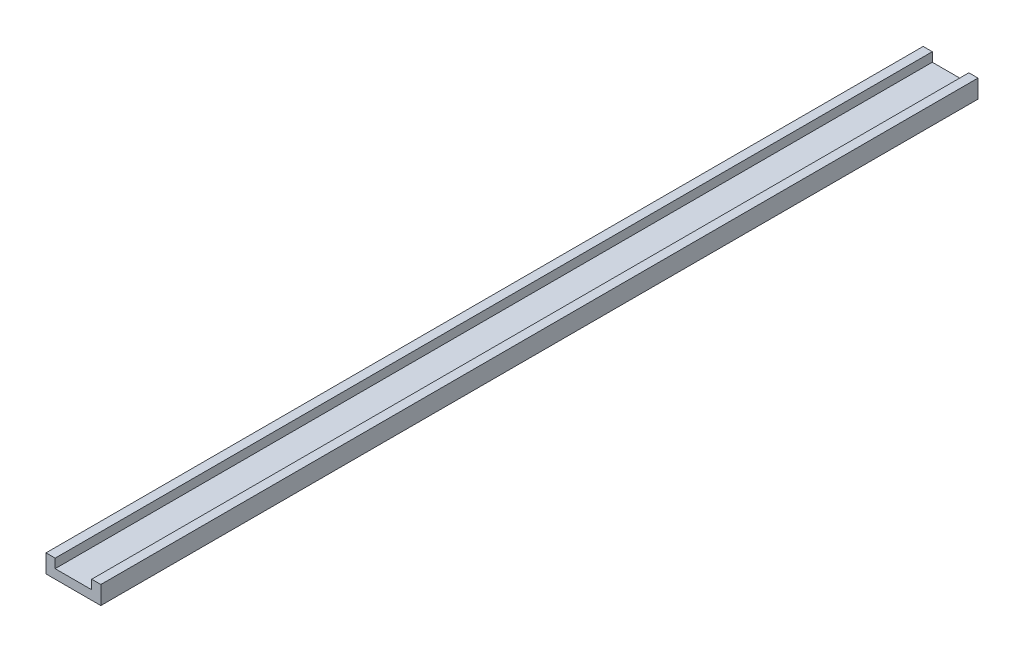
ISO-10303-21;
HEADER;
FILE_DESCRIPTION(('STEP AP214'),'2;1');
FILE_NAME('part.step','',(''),(''),'','','');
FILE_SCHEMA(('AUTOMOTIVE_DESIGN { 1 0 10303 214 1 1 1 1 }'));
ENDSEC;
DATA;
#1=APPLICATION_CONTEXT('core data for automotive mechanical design processes');
#2=APPLICATION_PROTOCOL_DEFINITION('international standard','automotive_design',2000,#1);
#3=PRODUCT_CONTEXT('',#1,'mechanical');
#4=PRODUCT('Part','Part','',(#3));
#5=PRODUCT_RELATED_PRODUCT_CATEGORY('part','',(#4));
#6=PRODUCT_DEFINITION_FORMATION('','',#4);
#7=PRODUCT_DEFINITION_CONTEXT('part definition',#1,'design');
#8=PRODUCT_DEFINITION('design','',#6,#7);
#9=PRODUCT_DEFINITION_SHAPE('','',#8);
#10=(LENGTH_UNIT() NAMED_UNIT(*) SI_UNIT(.MILLI.,.METRE.));
#11=(NAMED_UNIT(*) PLANE_ANGLE_UNIT() SI_UNIT($,.RADIAN.));
#12=(NAMED_UNIT(*) SI_UNIT($,.STERADIAN.) SOLID_ANGLE_UNIT());
#13=UNCERTAINTY_MEASURE_WITH_UNIT(LENGTH_MEASURE(1.E-05),#10,'distance_accuracy_value','');
#14=(GEOMETRIC_REPRESENTATION_CONTEXT(3) GLOBAL_UNCERTAINTY_ASSIGNED_CONTEXT((#13)) GLOBAL_UNIT_ASSIGNED_CONTEXT((#10,
#11,#12)) REPRESENTATION_CONTEXT('',''));
#15=CARTESIAN_POINT('',(0.,0.,0.));
#16=DIRECTION('',(0.,0.,1.));
#17=DIRECTION('',(1.,0.,0.));
#18=AXIS2_PLACEMENT_3D('',#15,#16,#17);
#19=CARTESIAN_POINT('',(0.,6.35,304.8));
#20=DIRECTION('',(0.,-1.,0.));
#21=DIRECTION('',(0.,0.,-1.));
#22=AXIS2_PLACEMENT_3D('',#19,#20,#21);
#23=PLANE('',#22);
#24=DIRECTION('',(-1.,0.,0.));
#25=VECTOR('',#24,1.);
#26=CARTESIAN_POINT('',(0.,6.35,304.8));
#27=LINE('',#26,#25);
#28=CARTESIAN_POINT('',(3.175,6.35,304.8));
#29=VERTEX_POINT('',#28);
#30=CARTESIAN_POINT('',(0.,6.35,304.8));
#31=VERTEX_POINT('',#30);
#32=EDGE_CURVE('E64',#29,#31,#27,.T.);
#33=ORIENTED_EDGE('',*,*,#32,.F.);
#34=DIRECTION('',(0.,0.,1.));
#35=VECTOR('',#34,1.);
#36=CARTESIAN_POINT('',(3.175,6.35,0.));
#37=LINE('',#36,#35);
#38=CARTESIAN_POINT('',(3.175,6.35,0.));
#39=VERTEX_POINT('',#38);
#40=EDGE_CURVE('E147',#39,#29,#37,.T.);
#41=ORIENTED_EDGE('',*,*,#40,.F.);
#42=DIRECTION('',(-1.,0.,0.));
#43=VECTOR('',#42,1.);
#44=CARTESIAN_POINT('',(0.,6.35,0.));
#45=LINE('',#44,#43);
#46=CARTESIAN_POINT('',(0.,6.35,0.));
#47=VERTEX_POINT('',#46);
#48=EDGE_CURVE('E86',#39,#47,#45,.T.);
#49=ORIENTED_EDGE('',*,*,#48,.T.);
#50=DIRECTION('',(0.,0.,-1.));
#51=VECTOR('',#50,1.);
#52=CARTESIAN_POINT('',(0.,6.35,304.8));
#53=LINE('',#52,#51);
#54=EDGE_CURVE('E170',#31,#47,#53,.T.);
#55=ORIENTED_EDGE('',*,*,#54,.F.);
#56=EDGE_LOOP('',(#33,#41,#49,#55));
#57=FACE_BOUND('',#56,.T.);
#58=ADVANCED_FACE('F39',(#57),#23,.F.);
#59=CARTESIAN_POINT('',(0.,0.,304.8));
#60=DIRECTION('',(1.,0.,0.));
#61=DIRECTION('',(0.,0.,-1.));
#62=AXIS2_PLACEMENT_3D('',#59,#60,#61);
#63=PLANE('',#62);
#64=DIRECTION('',(0.,-1.,0.));
#65=VECTOR('',#64,1.);
#66=CARTESIAN_POINT('',(0.,0.,0.));
#67=LINE('',#66,#65);
#68=CARTESIAN_POINT('',(0.,0.,0.));
#69=VERTEX_POINT('',#68);
#70=EDGE_CURVE('E150',#47,#69,#67,.T.);
#71=ORIENTED_EDGE('',*,*,#70,.T.);
#72=DIRECTION('',(0.,0.,-1.));
#73=VECTOR('',#72,1.);
#74=CARTESIAN_POINT('',(0.,0.,304.8));
#75=LINE('',#74,#73);
#76=CARTESIAN_POINT('',(0.,0.,304.8));
#77=VERTEX_POINT('',#76);
#78=EDGE_CURVE('E11',#77,#69,#75,.T.);
#79=ORIENTED_EDGE('',*,*,#78,.F.);
#80=DIRECTION('',(0.,-1.,0.));
#81=VECTOR('',#80,1.);
#82=CARTESIAN_POINT('',(0.,0.,304.8));
#83=LINE('',#82,#81);
#84=EDGE_CURVE('E157',#31,#77,#83,.T.);
#85=ORIENTED_EDGE('',*,*,#84,.F.);
#86=ORIENTED_EDGE('',*,*,#54,.T.);
#87=EDGE_LOOP('',(#71,#79,#85,#86));
#88=FACE_BOUND('',#87,.T.);
#89=ADVANCED_FACE('F41',(#88),#63,.F.);
#90=CARTESIAN_POINT('',(0.,0.,304.8));
#91=DIRECTION('',(0.,1.,0.));
#92=DIRECTION('',(0.,0.,1.));
#93=AXIS2_PLACEMENT_3D('',#90,#91,#92);
#94=PLANE('',#93);
#95=DIRECTION('',(1.,0.,0.));
#96=VECTOR('',#95,1.);
#97=CARTESIAN_POINT('',(0.,0.,0.));
#98=LINE('',#97,#96);
#99=CARTESIAN_POINT('',(19.05,0.,0.));
#100=VERTEX_POINT('',#99);
#101=EDGE_CURVE('E174',#69,#100,#98,.T.);
#102=ORIENTED_EDGE('',*,*,#101,.T.);
#103=DIRECTION('',(0.,0.,-1.));
#104=VECTOR('',#103,1.);
#105=CARTESIAN_POINT('',(19.05,0.,304.8));
#106=LINE('',#105,#104);
#107=CARTESIAN_POINT('',(19.05,0.,304.8));
#108=VERTEX_POINT('',#107);
#109=EDGE_CURVE('E48',#108,#100,#106,.T.);
#110=ORIENTED_EDGE('',*,*,#109,.F.);
#111=DIRECTION('',(1.,0.,0.));
#112=VECTOR('',#111,1.);
#113=CARTESIAN_POINT('',(0.,0.,304.8));
#114=LINE('',#113,#112);
#115=EDGE_CURVE('E93',#77,#108,#114,.T.);
#116=ORIENTED_EDGE('',*,*,#115,.F.);
#117=ORIENTED_EDGE('',*,*,#78,.T.);
#118=EDGE_LOOP('',(#102,#110,#116,#117));
#119=FACE_BOUND('',#118,.T.);
#120=ADVANCED_FACE('F204',(#119),#94,.F.);
#121=CARTESIAN_POINT('',(19.05,0.,304.8));
#122=DIRECTION('',(-1.,0.,0.));
#123=DIRECTION('',(0.,0.,1.));
#124=AXIS2_PLACEMENT_3D('',#121,#122,#123);
#125=PLANE('',#124);
#126=DIRECTION('',(0.,1.,0.));
#127=VECTOR('',#126,1.);
#128=CARTESIAN_POINT('',(19.05,0.,0.));
#129=LINE('',#128,#127);
#130=CARTESIAN_POINT('',(19.05,6.35,0.));
#131=VERTEX_POINT('',#130);
#132=EDGE_CURVE('E177',#100,#131,#129,.T.);
#133=ORIENTED_EDGE('',*,*,#132,.T.);
#134=DIRECTION('',(0.,0.,-1.));
#135=VECTOR('',#134,1.);
#136=CARTESIAN_POINT('',(19.05,6.35,304.8));
#137=LINE('',#136,#135);
#138=CARTESIAN_POINT('',(19.05,6.35,304.8));
#139=VERTEX_POINT('',#138);
#140=EDGE_CURVE('E185',#139,#131,#137,.T.);
#141=ORIENTED_EDGE('',*,*,#140,.F.);
#142=DIRECTION('',(0.,1.,0.));
#143=VECTOR('',#142,1.);
#144=CARTESIAN_POINT('',(19.05,0.,304.8));
#145=LINE('',#144,#143);
#146=EDGE_CURVE('E163',#108,#139,#145,.T.);
#147=ORIENTED_EDGE('',*,*,#146,.F.);
#148=ORIENTED_EDGE('',*,*,#109,.T.);
#149=EDGE_LOOP('',(#133,#141,#147,#148));
#150=FACE_BOUND('',#149,.T.);
#151=ADVANCED_FACE('F193',(#150),#125,.F.);
#152=CARTESIAN_POINT('',(15.875,6.35,0.));
#153=VERTEX_POINT('',#152);
#154=EDGE_CURVE('E160',#131,#153,#45,.T.);
#155=ORIENTED_EDGE('',*,*,#154,.T.);
#156=DIRECTION('',(0.,0.,1.));
#157=VECTOR('',#156,1.);
#158=CARTESIAN_POINT('',(15.875,6.35,0.));
#159=LINE('',#158,#157);
#160=CARTESIAN_POINT('',(15.875,6.35,304.8));
#161=VERTEX_POINT('',#160);
#162=EDGE_CURVE('E151',#153,#161,#159,.T.);
#163=ORIENTED_EDGE('',*,*,#162,.T.);
#164=EDGE_CURVE('E166',#139,#161,#27,.T.);
#165=ORIENTED_EDGE('',*,*,#164,.F.);
#166=ORIENTED_EDGE('',*,*,#140,.T.);
#167=EDGE_LOOP('',(#155,#163,#165,#166));
#168=FACE_BOUND('',#167,.T.);
#169=ADVANCED_FACE('F197',(#168),#23,.F.);
#170=CARTESIAN_POINT('',(0.,0.,304.8));
#171=DIRECTION('',(0.,0.,-1.));
#172=DIRECTION('',(-1.,0.,0.));
#173=AXIS2_PLACEMENT_3D('',#170,#171,#172);
#174=PLANE('',#173);
#175=DIRECTION('',(1.,0.,0.));
#176=VECTOR('',#175,1.);
#177=CARTESIAN_POINT('',(3.175,3.175,304.8));
#178=LINE('',#177,#176);
#179=CARTESIAN_POINT('',(3.175,3.175,304.8));
#180=VERTEX_POINT('',#179);
#181=CARTESIAN_POINT('',(15.875,3.175,304.8));
#182=VERTEX_POINT('',#181);
#183=EDGE_CURVE('E138',#180,#182,#178,.T.);
#184=ORIENTED_EDGE('',*,*,#183,.F.);
#185=DIRECTION('',(0.,-1.,0.));
#186=VECTOR('',#185,1.);
#187=CARTESIAN_POINT('',(3.175,6.35,304.8));
#188=LINE('',#187,#186);
#189=EDGE_CURVE('E119',#29,#180,#188,.T.);
#190=ORIENTED_EDGE('',*,*,#189,.F.);
#191=ORIENTED_EDGE('',*,*,#32,.T.);
#192=ORIENTED_EDGE('',*,*,#84,.T.);
#193=ORIENTED_EDGE('',*,*,#115,.T.);
#194=ORIENTED_EDGE('',*,*,#146,.T.);
#195=ORIENTED_EDGE('',*,*,#164,.T.);
#196=DIRECTION('',(0.,1.,0.));
#197=VECTOR('',#196,1.);
#198=CARTESIAN_POINT('',(15.875,6.35,304.8));
#199=LINE('',#198,#197);
#200=EDGE_CURVE('E135',#182,#161,#199,.T.);
#201=ORIENTED_EDGE('',*,*,#200,.F.);
#202=EDGE_LOOP('',(#184,#190,#191,#192,#193,#194,#195,#201));
#203=FACE_BOUND('',#202,.T.);
#204=ADVANCED_FACE('F200',(#203),#174,.F.);
#205=CARTESIAN_POINT('',(0.,0.,0.));
#206=DIRECTION('',(0.,0.,-1.));
#207=DIRECTION('',(-1.,0.,0.));
#208=AXIS2_PLACEMENT_3D('',#205,#206,#207);
#209=PLANE('',#208);
#210=DIRECTION('',(0.,-1.,0.));
#211=VECTOR('',#210,1.);
#212=CARTESIAN_POINT('',(3.175,6.35,0.));
#213=LINE('',#212,#211);
#214=CARTESIAN_POINT('',(3.175,3.175,0.));
#215=VERTEX_POINT('',#214);
#216=EDGE_CURVE('E118',#39,#215,#213,.T.);
#217=ORIENTED_EDGE('',*,*,#216,.T.);
#218=DIRECTION('',(1.,0.,0.));
#219=VECTOR('',#218,1.);
#220=CARTESIAN_POINT('',(3.175,3.175,0.));
#221=LINE('',#220,#219);
#222=CARTESIAN_POINT('',(15.875,3.175,0.));
#223=VERTEX_POINT('',#222);
#224=EDGE_CURVE('E127',#215,#223,#221,.T.);
#225=ORIENTED_EDGE('',*,*,#224,.T.);
#226=DIRECTION('',(0.,1.,0.));
#227=VECTOR('',#226,1.);
#228=CARTESIAN_POINT('',(15.875,6.35,0.));
#229=LINE('',#228,#227);
#230=EDGE_CURVE('E55',#223,#153,#229,.T.);
#231=ORIENTED_EDGE('',*,*,#230,.T.);
#232=ORIENTED_EDGE('',*,*,#154,.F.);
#233=ORIENTED_EDGE('',*,*,#132,.F.);
#234=ORIENTED_EDGE('',*,*,#101,.F.);
#235=ORIENTED_EDGE('',*,*,#70,.F.);
#236=ORIENTED_EDGE('',*,*,#48,.F.);
#237=EDGE_LOOP('',(#217,#225,#231,#232,#233,#234,#235,#236));
#238=FACE_BOUND('',#237,.T.);
#239=ADVANCED_FACE('F132',(#238),#209,.T.);
#240=CARTESIAN_POINT('',(3.175,6.35,0.));
#241=DIRECTION('',(-1.,0.,0.));
#242=DIRECTION('',(0.,-1.,0.));
#243=AXIS2_PLACEMENT_3D('',#240,#241,#242);
#244=PLANE('',#243);
#245=ORIENTED_EDGE('',*,*,#189,.T.);
#246=DIRECTION('',(0.,0.,1.));
#247=VECTOR('',#246,1.);
#248=CARTESIAN_POINT('',(3.175,3.175,0.));
#249=LINE('',#248,#247);
#250=EDGE_CURVE('E114',#215,#180,#249,.T.);
#251=ORIENTED_EDGE('',*,*,#250,.F.);
#252=ORIENTED_EDGE('',*,*,#216,.F.);
#253=ORIENTED_EDGE('',*,*,#40,.T.);
#254=EDGE_LOOP('',(#245,#251,#252,#253));
#255=FACE_BOUND('',#254,.T.);
#256=ADVANCED_FACE('F116',(#255),#244,.F.);
#257=CARTESIAN_POINT('',(15.875,6.35,0.));
#258=DIRECTION('',(1.,0.,0.));
#259=DIRECTION('',(0.,0.,-1.));
#260=AXIS2_PLACEMENT_3D('',#257,#258,#259);
#261=PLANE('',#260);
#262=ORIENTED_EDGE('',*,*,#200,.T.);
#263=ORIENTED_EDGE('',*,*,#162,.F.);
#264=ORIENTED_EDGE('',*,*,#230,.F.);
#265=DIRECTION('',(0.,0.,1.));
#266=VECTOR('',#265,1.);
#267=CARTESIAN_POINT('',(15.875,3.175,0.));
#268=LINE('',#267,#266);
#269=EDGE_CURVE('E124',#223,#182,#268,.T.);
#270=ORIENTED_EDGE('',*,*,#269,.T.);
#271=EDGE_LOOP('',(#262,#263,#264,#270));
#272=FACE_BOUND('',#271,.T.);
#273=ADVANCED_FACE('F227',(#272),#261,.F.);
#274=CARTESIAN_POINT('',(3.175,3.175,0.));
#275=DIRECTION('',(0.,-1.,0.));
#276=DIRECTION('',(0.,0.,-1.));
#277=AXIS2_PLACEMENT_3D('',#274,#275,#276);
#278=PLANE('',#277);
#279=ORIENTED_EDGE('',*,*,#183,.T.);
#280=ORIENTED_EDGE('',*,*,#269,.F.);
#281=ORIENTED_EDGE('',*,*,#224,.F.);
#282=ORIENTED_EDGE('',*,*,#250,.T.);
#283=EDGE_LOOP('',(#279,#280,#281,#282));
#284=FACE_BOUND('',#283,.T.);
#285=ADVANCED_FACE('F128',(#284),#278,.F.);
#286=CLOSED_SHELL('',(#58,#89,#120,#151,#169,#204,#239,#256,#273,#285));
#287=MANIFOLD_SOLID_BREP('B2',#286);
#288=ADVANCED_BREP_SHAPE_REPRESENTATION('',(#18,#287),#14);
#289=SHAPE_DEFINITION_REPRESENTATION(#9,#288);
ENDSEC;
END-ISO-10303-21;
